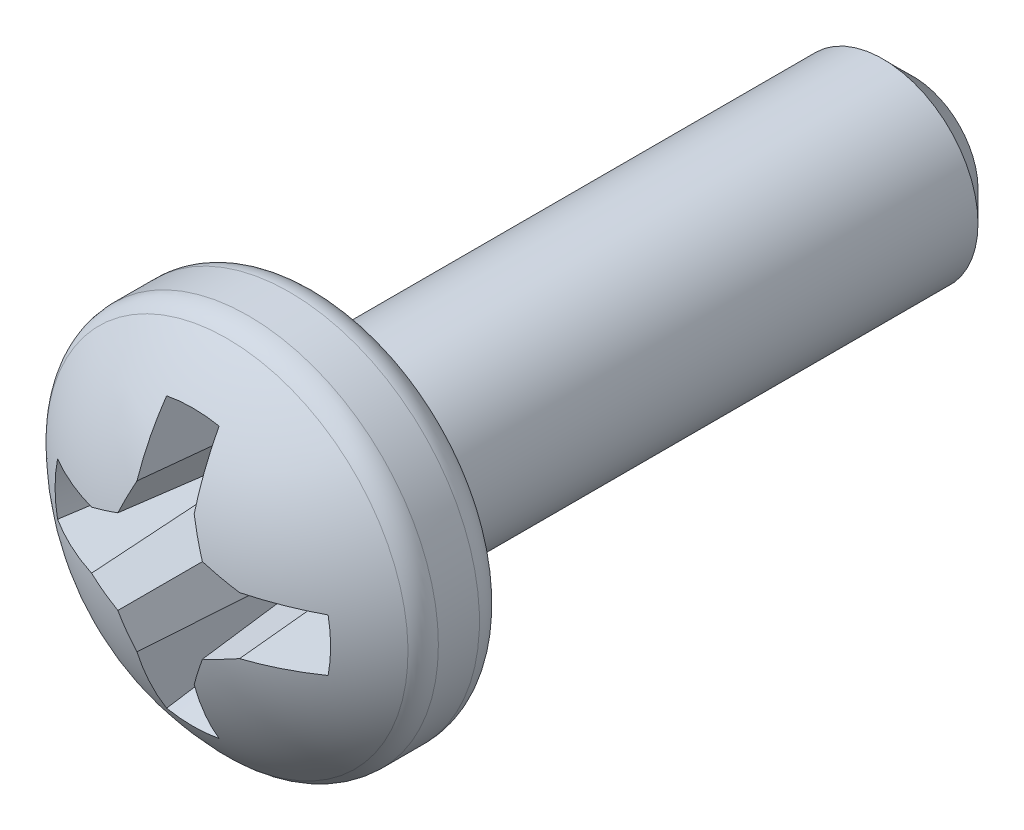
ISO-10303-21;
HEADER;
FILE_DESCRIPTION(('STEP AP214'),'2;1');
FILE_NAME('part.step','',(''),(''),'','','');
FILE_SCHEMA(('AUTOMOTIVE_DESIGN { 1 0 10303 214 1 1 1 1 }'));
ENDSEC;
DATA;
#1=APPLICATION_CONTEXT('core data for automotive mechanical design processes');
#2=APPLICATION_PROTOCOL_DEFINITION('international standard','automotive_design',2000,#1);
#3=PRODUCT_CONTEXT('',#1,'mechanical');
#4=PRODUCT('Part','Part','',(#3));
#5=PRODUCT_RELATED_PRODUCT_CATEGORY('part','',(#4));
#6=PRODUCT_DEFINITION_FORMATION('','',#4);
#7=PRODUCT_DEFINITION_CONTEXT('part definition',#1,'design');
#8=PRODUCT_DEFINITION('design','',#6,#7);
#9=PRODUCT_DEFINITION_SHAPE('','',#8);
#10=(LENGTH_UNIT() NAMED_UNIT(*) SI_UNIT(.MILLI.,.METRE.));
#11=(NAMED_UNIT(*) PLANE_ANGLE_UNIT() SI_UNIT($,.RADIAN.));
#12=(NAMED_UNIT(*) SI_UNIT($,.STERADIAN.) SOLID_ANGLE_UNIT());
#13=UNCERTAINTY_MEASURE_WITH_UNIT(LENGTH_MEASURE(1.E-05),#10,'distance_accuracy_value','');
#14=(GEOMETRIC_REPRESENTATION_CONTEXT(3) GLOBAL_UNCERTAINTY_ASSIGNED_CONTEXT((#13)) GLOBAL_UNIT_ASSIGNED_CONTEXT((#10,
#11,#12)) REPRESENTATION_CONTEXT('',''));
#15=CARTESIAN_POINT('',(0.,0.,0.));
#16=DIRECTION('',(0.,0.,1.));
#17=DIRECTION('',(1.,0.,0.));
#18=AXIS2_PLACEMENT_3D('',#15,#16,#17);
#19=CARTESIAN_POINT('',(-1.1583216746158,0.791461441644268,0.413196607862429));
#20=DIRECTION('',(0.,0.,1.));
#21=DIRECTION('',(1.,0.,0.));
#22=AXIS2_PLACEMENT_3D('',#19,#20,#21);
#23=PLANE('',#22);
#24=DIRECTION('',(0.382683432365081,-0.92387953251129,0.));
#25=VECTOR('',#24,1.);
#26=CARTESIAN_POINT('',(-1.14500778784592,0.796976234112247,0.413196607862429));
#27=LINE('',#26,#25);
#28=CARTESIAN_POINT('',(-1.1525780332613,0.815252423264536,0.413196607862429));
#29=VERTEX_POINT('',#28);
#30=CARTESIAN_POINT('',(-1.14729208967984,0.802491026580227,0.413196607862429));
#31=VERTEX_POINT('',#30);
#32=EDGE_CURVE('E292',#29,#31,#27,.T.);
#33=ORIENTED_EDGE('',*,*,#32,.F.);
#34=DIRECTION('',(0.,1.,0.));
#35=VECTOR('',#34,1.);
#36=CARTESIAN_POINT('',(-1.15257803326131,0.791461441644268,0.413196607862429));
#37=LINE('',#36,#35);
#38=CARTESIAN_POINT('',(-1.15257803326131,0.827667770292575,0.413196607862429));
#39=VERTEX_POINT('',#38);
#40=EDGE_CURVE('E168',#39,#29,#37,.F.);
#41=ORIENTED_EDGE('',*,*,#40,.F.);
#42=CARTESIAN_POINT('',(-1.1583216746158,0.791461441644268,0.413196607862429));
#43=DIRECTION('',(0.,0.,1.));
#44=DIRECTION('',(1.,0.,0.));
#45=AXIS2_PLACEMENT_3D('',#42,#43,#44);
#46=CIRCLE('',#45,0.0366590732315792);
#47=CARTESIAN_POINT('',(-1.16406531597029,0.827667770292577,0.413196607862429));
#48=VERTEX_POINT('',#47);
#49=EDGE_CURVE('E159',#39,#48,#46,.T.);
#50=ORIENTED_EDGE('',*,*,#49,.T.);
#51=DIRECTION('',(0.,1.,0.));
#52=VECTOR('',#51,1.);
#53=CARTESIAN_POINT('',(-1.16406531597029,0.791461441644271,0.413196607862429));
#54=LINE('',#53,#52);
#55=CARTESIAN_POINT('',(-1.16406531597029,0.815252423264539,0.413196607862429));
#56=VERTEX_POINT('',#55);
#57=EDGE_CURVE('E166',#56,#48,#54,.T.);
#58=ORIENTED_EDGE('',*,*,#57,.F.);
#59=DIRECTION('',(0.382683432365079,0.923879532511291,0.));
#60=VECTOR('',#59,1.);
#61=CARTESIAN_POINT('',(-1.17163556138567,0.79697623411225,0.413196607862429));
#62=LINE('',#61,#60);
#63=CARTESIAN_POINT('',(-1.16935125955175,0.80249102658023,0.413196607862429));
#64=VERTEX_POINT('',#63);
#65=EDGE_CURVE('E301',#64,#56,#62,.T.);
#66=ORIENTED_EDGE('',*,*,#65,.F.);
#67=DIRECTION('',(0.923879532511289,0.382683432365086,0.));
#68=VECTOR('',#67,1.);
#69=CARTESIAN_POINT('',(-1.16383646708377,0.804775328414139,0.413196607862429));
#70=LINE('',#69,#68);
#71=CARTESIAN_POINT('',(-1.18211265623606,0.797205082998765,0.413196607862429));
#72=VERTEX_POINT('',#71);
#73=EDGE_CURVE('E307',#72,#64,#70,.T.);
#74=ORIENTED_EDGE('',*,*,#73,.F.);
#75=DIRECTION('',(1.,0.,0.));
#76=VECTOR('',#75,1.);
#77=CARTESIAN_POINT('',(-1.15832167461579,0.797205082998765,0.413196607862429));
#78=LINE('',#77,#76);
#79=CARTESIAN_POINT('',(-1.19452800332347,0.797205082997996,0.413196607853643));
#80=VERTEX_POINT('',#79);
#81=EDGE_CURVE('E313',#80,#72,#78,.T.);
#82=ORIENTED_EDGE('',*,*,#81,.F.);
#83=CARTESIAN_POINT('',(-1.15832167461579,0.791461441644271,0.413196607862429));
#84=DIRECTION('',(0.,0.,1.));
#85=DIRECTION('',(1.,0.,0.));
#86=AXIS2_PLACEMENT_3D('',#83,#84,#85);
#87=CIRCLE('',#86,0.0366590732924525);
#88=CARTESIAN_POINT('',(-1.19452800332573,0.78571780028978,0.413196607862429));
#89=VERTEX_POINT('',#88);
#90=EDGE_CURVE('E410',#80,#89,#87,.T.);
#91=ORIENTED_EDGE('',*,*,#90,.T.);
#92=DIRECTION('',(1.,0.,0.));
#93=VECTOR('',#92,1.);
#94=CARTESIAN_POINT('',(-1.1583216746158,0.78571780028978,0.413196607862429));
#95=LINE('',#94,#93);
#96=CARTESIAN_POINT('',(-1.18211265623607,0.78571780028978,0.413196607862429));
#97=VERTEX_POINT('',#96);
#98=EDGE_CURVE('E247',#97,#89,#95,.F.);
#99=ORIENTED_EDGE('',*,*,#98,.F.);
#100=DIRECTION('',(-0.923879532511292,0.382683432365076,0.));
#101=VECTOR('',#100,1.);
#102=CARTESIAN_POINT('',(-1.16383646708378,0.778147554874406,0.413196607862429));
#103=LINE('',#102,#101);
#104=CARTESIAN_POINT('',(-1.16935125955175,0.780431856708312,0.413196607862429));
#105=VERTEX_POINT('',#104);
#106=EDGE_CURVE('E248',#105,#97,#103,.T.);
#107=ORIENTED_EDGE('',*,*,#106,.F.);
#108=DIRECTION('',(-0.38268343236509,0.923879532511287,0.));
#109=VECTOR('',#108,1.);
#110=CARTESIAN_POINT('',(-1.17163556138567,0.785946649176296,0.413196607862429));
#111=LINE('',#110,#109);
#112=CARTESIAN_POINT('',(-1.16406531597029,0.767670460024005,0.413196607862429));
#113=VERTEX_POINT('',#112);
#114=EDGE_CURVE('E254',#113,#105,#111,.T.);
#115=ORIENTED_EDGE('',*,*,#114,.F.);
#116=DIRECTION('',(0.,1.,0.));
#117=VECTOR('',#116,1.);
#118=CARTESIAN_POINT('',(-1.16406531597029,0.791461441644275,0.413196607862429));
#119=LINE('',#118,#117);
#120=CARTESIAN_POINT('',(-1.16406531597029,0.755255112953835,0.413196607862429));
#121=VERTEX_POINT('',#120);
#122=EDGE_CURVE('E260',#121,#113,#119,.T.);
#123=ORIENTED_EDGE('',*,*,#122,.F.);
#124=CARTESIAN_POINT('',(-1.1583216746158,0.791461441644275,0.413196607862429));
#125=DIRECTION('',(0.,0.,1.));
#126=DIRECTION('',(1.,0.,0.));
#127=AXIS2_PLACEMENT_3D('',#124,#125,#126);
#128=CIRCLE('',#127,0.036659073273191);
#129=CARTESIAN_POINT('',(-1.1525780332613,0.755255112953836,0.413196607862429));
#130=VERTEX_POINT('',#129);
#131=EDGE_CURVE('E336',#121,#130,#128,.T.);
#132=ORIENTED_EDGE('',*,*,#131,.T.);
#133=DIRECTION('',(0.,1.,0.));
#134=VECTOR('',#133,1.);
#135=CARTESIAN_POINT('',(-1.1525780332613,0.791461441644272,0.413196607862429));
#136=LINE('',#135,#134);
#137=CARTESIAN_POINT('',(-1.15257803326131,0.767670460024002,0.413196607862429));
#138=VERTEX_POINT('',#137);
#139=EDGE_CURVE('E266',#138,#130,#136,.F.);
#140=ORIENTED_EDGE('',*,*,#139,.F.);
#141=DIRECTION('',(-0.382683432365075,-0.923879532511293,0.));
#142=VECTOR('',#141,1.);
#143=CARTESIAN_POINT('',(-1.14500778784593,0.785946649176293,0.413196607862429));
#144=LINE('',#143,#142);
#145=CARTESIAN_POINT('',(-1.14729208967984,0.780431856708314,0.413196607862429));
#146=VERTEX_POINT('',#145);
#147=EDGE_CURVE('E267',#146,#138,#144,.T.);
#148=ORIENTED_EDGE('',*,*,#147,.F.);
#149=DIRECTION('',(-0.923879532511286,-0.382683432365092,0.));
#150=VECTOR('',#149,1.);
#151=CARTESIAN_POINT('',(-1.15280688214782,0.778147554874402,0.413196607862429));
#152=LINE('',#151,#150);
#153=CARTESIAN_POINT('',(-1.13453069299553,0.785717800289777,0.413196607862429));
#154=VERTEX_POINT('',#153);
#155=EDGE_CURVE('E273',#154,#146,#152,.T.);
#156=ORIENTED_EDGE('',*,*,#155,.F.);
#157=DIRECTION('',(1.,0.,0.));
#158=VECTOR('',#157,1.);
#159=CARTESIAN_POINT('',(-1.1583216746158,0.785717800289777,0.413196607862429));
#160=LINE('',#159,#158);
#161=CARTESIAN_POINT('',(-1.12211534596749,0.785717800289777,0.413196607862429));
#162=VERTEX_POINT('',#161);
#163=EDGE_CURVE('E279',#162,#154,#160,.F.);
#164=ORIENTED_EDGE('',*,*,#163,.F.);
#165=CARTESIAN_POINT('',(-1.1583216746158,0.791461441644268,0.413196607862429));
#166=DIRECTION('',(0.,0.,1.));
#167=DIRECTION('',(1.,0.,0.));
#168=AXIS2_PLACEMENT_3D('',#165,#166,#167);
#169=CIRCLE('',#168,0.0366590732315792);
#170=CARTESIAN_POINT('',(-1.12211534596749,0.797205082998762,0.413196607862429));
#171=VERTEX_POINT('',#170);
#172=EDGE_CURVE('E492',#162,#171,#169,.T.);
#173=ORIENTED_EDGE('',*,*,#172,.T.);
#174=DIRECTION('',(1.,0.,0.));
#175=VECTOR('',#174,1.);
#176=CARTESIAN_POINT('',(-1.1583216746158,0.797205082998762,0.413196607862429));
#177=LINE('',#176,#175);
#178=CARTESIAN_POINT('',(-1.13453069299553,0.797205082998762,0.413196607862429));
#179=VERTEX_POINT('',#178);
#180=EDGE_CURVE('E285',#179,#171,#177,.T.);
#181=ORIENTED_EDGE('',*,*,#180,.F.);
#182=DIRECTION('',(0.92387953251129,-0.382683432365083,0.));
#183=VECTOR('',#182,1.);
#184=CARTESIAN_POINT('',(-1.15280688214782,0.804775328414136,0.413196607862429));
#185=LINE('',#184,#183);
#186=EDGE_CURVE('E286',#31,#179,#185,.T.);
#187=ORIENTED_EDGE('',*,*,#186,.F.);
#188=EDGE_LOOP('',(#33,#41,#50,#58,#66,#74,#82,#91,#99,#107,#115,#123,#132,#140,#148,#156,#164,
#173,#181,#187));
#189=FACE_BOUND('',#188,.T.);
#190=ADVANCED_FACE('F17',(#189),#23,.T.);
#191=CARTESIAN_POINT('',(-1.15832167461579,0.801303961329311,0.460047001563216));
#192=DIRECTION('',(0.,-0.996194698091744,0.0871557427476727));
#193=DIRECTION('',(0.,-0.0871557427476727,-0.996194698091744));
#194=AXIS2_PLACEMENT_3D('',#191,#192,#193);
#195=PLANE('',#194);
#196=DIRECTION('',(0.0173337504938674,-0.0871426484044457,-0.996045029063885));
#197=VECTOR('',#196,1.);
#198=CARTESIAN_POINT('',(-1.18285605674042,0.8009424097128,0.455914447676356));
#199=LINE('',#198,#197);
#200=CARTESIAN_POINT('',(-1.18285605674042,0.8009424097128,0.455914447676357));
#201=VERTEX_POINT('',#200);
#202=EDGE_CURVE('E310',#201,#72,#199,.T.);
#203=ORIENTED_EDGE('',*,*,#202,.F.);
#204=CARTESIAN_POINT('',(-1.2031693076876,0.800151088875881,0.4468696091221));
#205=CARTESIAN_POINT('',(-1.19998094800443,0.800321424804083,0.448816557690385));
#206=CARTESIAN_POINT('',(-1.19669399725059,0.800472536171256,0.450543768520715));
#207=CARTESIAN_POINT('',(-1.18992291360155,0.800736309783544,0.453558714705463));
#208=CARTESIAN_POINT('',(-1.18643878070636,0.800848972028658,0.454846450059882));
#209=CARTESIAN_POINT('',(-1.18285605674048,0.800942409712743,0.455914447676345));
#210=B_SPLINE_CURVE_WITH_KNOTS('',3,(#204,#205,#206,#207,#208,#209),.UNSPECIFIED.,.F.,.F.,(4,2,
4),(0.,0.0111485978671283,0.0222971957342563),.UNSPECIFIED.);
#211=CARTESIAN_POINT('',(-1.20316930767702,0.800151088874494,0.446869609106246));
#212=VERTEX_POINT('',#211);
#213=EDGE_CURVE('E409',#212,#201,#210,.T.);
#214=ORIENTED_EDGE('',*,*,#213,.F.);
#215=CARTESIAN_POINT('',(-1.20316930766644,0.800151088873107,0.446869609090393));
#216=CARTESIAN_POINT('',(-1.20173283988868,0.79966000435443,0.441256487356839));
#217=CARTESIAN_POINT('',(-1.20029449731313,0.799168961608414,0.435643843086987));
#218=CARTESIAN_POINT('',(-1.19741406253147,0.798186959649786,0.424419509338453));
#219=CARTESIAN_POINT('',(-1.19597197032528,0.797696000437175,0.418807819859795));
#220=CARTESIAN_POINT('',(-1.19452800332121,0.797205082997228,0.413196607844861));
#221=B_SPLINE_CURVE_WITH_KNOTS('',3,(#215,#216,#217,#218,#219,#220),.UNSPECIFIED.,.F.,.F.,(4,2,
4),(0.,0.0174443558891334,0.034888712201717),.UNSPECIFIED.);
#222=EDGE_CURVE('E318',#212,#80,#221,.T.);
#223=ORIENTED_EDGE('',*,*,#222,.T.);
#224=ORIENTED_EDGE('',*,*,#81,.T.);
#225=EDGE_LOOP('',(#203,#214,#223,#224));
#226=FACE_BOUND('',#225,.T.);
#227=ADVANCED_FACE('F427',(#226),#195,.T.);
#228=CARTESIAN_POINT('',(-1.16540503991215,0.808562198209984,0.460047001563216));
#229=DIRECTION('',(0.381227206369649,-0.920363891963225,0.0871557427476661));
#230=DIRECTION('',(0.923879532511289,0.382683432365086,0.));
#231=AXIS2_PLACEMENT_3D('',#228,#229,#230);
#232=PLANE('',#231);
#233=DIRECTION('',(0.0666626913468175,-0.0666626913468514,-0.995546167269401));
#234=VECTOR('',#233,1.);
#235=CARTESIAN_POINT('',(-1.17233303830332,0.805472805331793,0.457726739301585));
#236=LINE('',#235,#234);
#237=CARTESIAN_POINT('',(-1.17233303830332,0.805472805331793,0.457726739301586));
#238=VERTEX_POINT('',#237);
#239=EDGE_CURVE('E304',#238,#64,#236,.T.);
#240=ORIENTED_EDGE('',*,*,#239,.F.);
#241=CARTESIAN_POINT('',(-1.18285605674042,0.8009424097128,0.455914447676357));
#242=CARTESIAN_POINT('',(-1.18112568718549,0.801700049456702,0.4563463218226));
#243=CARTESIAN_POINT('',(-1.17938358420493,0.802456402296903,0.456713283197824));
#244=CARTESIAN_POINT('',(-1.17587591139256,0.803966534169899,0.457317380406234));
#245=CARTESIAN_POINT('',(-1.17411034156075,0.804720313202696,0.45755451623942));
#246=CARTESIAN_POINT('',(-1.17233303830331,0.80547280533179,0.457726739301587));
#247=B_SPLINE_CURVE_WITH_KNOTS('',3,(#241,#242,#243,#244,#245,#246),.UNSPECIFIED.,.F.,.F.,(4,2,
4),(0.,0.0058030059091772,0.0116060118183545),.UNSPECIFIED.);
#248=EDGE_CURVE('E439',#201,#238,#247,.T.);
#249=ORIENTED_EDGE('',*,*,#248,.F.);
#250=ORIENTED_EDGE('',*,*,#202,.T.);
#251=ORIENTED_EDGE('',*,*,#73,.T.);
#252=EDGE_LOOP('',(#240,#249,#250,#251));
#253=FACE_BOUND('',#252,.T.);
#254=ADVANCED_FACE('F431',(#253),#232,.T.);
#255=CARTESIAN_POINT('',(-1.17542243118151,0.79854480694063,0.460047001563216));
#256=DIRECTION('',(0.920363891963229,-0.381227206369643,0.0871557427476506));
#257=DIRECTION('',(0.382683432365079,0.923879532511291,0.));
#258=AXIS2_PLACEMENT_3D('',#255,#256,#257);
#259=PLANE('',#258);
#260=DIRECTION('',(0.0871426484044308,-0.0173337504938857,-0.996045029063886));
#261=VECTOR('',#260,1.);
#262=CARTESIAN_POINT('',(-1.16780264268432,0.8159958237689,0.455914447676355));
#263=LINE('',#262,#261);
#264=CARTESIAN_POINT('',(-1.16780264268432,0.8159958237689,0.455914447676355));
#265=VERTEX_POINT('',#264);
#266=EDGE_CURVE('E176',#265,#56,#263,.T.);
#267=ORIENTED_EDGE('',*,*,#266,.F.);
#268=CARTESIAN_POINT('',(-1.17233303830332,0.805472805331793,0.457726739301586));
#269=CARTESIAN_POINT('',(-1.17158054617422,0.807250108589228,0.457554516239418));
#270=CARTESIAN_POINT('',(-1.17082676714142,0.809015678421038,0.457317380406232));
#271=CARTESIAN_POINT('',(-1.16931663526843,0.812523351233407,0.456713283197821));
#272=CARTESIAN_POINT('',(-1.16856028242823,0.814265454213967,0.456346321822597));
#273=CARTESIAN_POINT('',(-1.16780264268432,0.815995823768902,0.455914447676354));
#274=B_SPLINE_CURVE_WITH_KNOTS('',3,(#268,#269,#270,#271,#272,#273),.UNSPECIFIED.,.F.,.F.,(4,2,
4),(0.,0.00580300590917752,0.0116060118183552),.UNSPECIFIED.);
#275=EDGE_CURVE('E445',#238,#265,#274,.T.);
#276=ORIENTED_EDGE('',*,*,#275,.F.);
#277=ORIENTED_EDGE('',*,*,#239,.T.);
#278=ORIENTED_EDGE('',*,*,#65,.T.);
#279=EDGE_LOOP('',(#267,#276,#277,#278));
#280=FACE_BOUND('',#279,.T.);
#281=ADVANCED_FACE('F436',(#280),#259,.T.);
#282=CARTESIAN_POINT('',(-1.16816419430083,0.791461441644271,0.460047001563216));
#283=DIRECTION('',(0.996194698091747,0.,0.0871557427476441));
#284=DIRECTION('',(0.0871557427476441,0.,-0.996194698091747));
#285=AXIS2_PLACEMENT_3D('',#282,#283,#284);
#286=PLANE('',#285);
#287=CARTESIAN_POINT('',(-1.16406531597622,0.827667770301505,0.413196607882833));
#288=CARTESIAN_POINT('',(-1.164556233414,0.829111737310763,0.41880781989674));
#289=CARTESIAN_POINT('',(-1.16504719262512,0.830553829522724,0.424419509374164));
#290=CARTESIAN_POINT('',(-1.16602919458211,0.833434264317094,0.435643843119816));
#291=CARTESIAN_POINT('',(-1.16652023732799,0.834872606899593,0.44125648738802));
#292=CARTESIAN_POINT('',(-1.16701132184719,0.836309074684887,0.446869609119717));
#293=B_SPLINE_CURVE_WITH_KNOTS('',3,(#287,#288,#289,#290,#291,#292),.UNSPECIFIED.,.F.,.F.,(4,2,
4),(0.,0.0174443563129265,0.0348887122024039),.UNSPECIFIED.);
#294=CARTESIAN_POINT('',(-1.16701132184662,0.836309074683216,0.446869609113192));
#295=VERTEX_POINT('',#294);
#296=EDGE_CURVE('E170',#48,#295,#293,.T.);
#297=ORIENTED_EDGE('',*,*,#296,.T.);
#298=CARTESIAN_POINT('',(-1.16780264268432,0.815995823768901,0.455914447676355));
#299=CARTESIAN_POINT('',(-1.16770920500028,0.819578547731976,0.454846450060737));
#300=CARTESIAN_POINT('',(-1.16759654275525,0.823062680624549,0.453558714707491));
#301=CARTESIAN_POINT('',(-1.16733276914321,0.82983376426869,0.450543768525744));
#302=CARTESIAN_POINT('',(-1.1671816577762,0.833120715020258,0.448816557697243));
#303=CARTESIAN_POINT('',(-1.16701132184819,0.836309074701324,0.446869609131115));
#304=B_SPLINE_CURVE_WITH_KNOTS('',3,(#298,#299,#300,#301,#302,#303),.UNSPECIFIED.,.F.,.F.,(4,2,
4),(0.,0.0111485978585235,0.022297195717047),.UNSPECIFIED.);
#305=EDGE_CURVE('E450',#265,#295,#304,.T.);
#306=ORIENTED_EDGE('',*,*,#305,.F.);
#307=ORIENTED_EDGE('',*,*,#266,.T.);
#308=ORIENTED_EDGE('',*,*,#57,.T.);
#309=EDGE_LOOP('',(#297,#306,#307,#308));
#310=FACE_BOUND('',#309,.T.);
#311=ADVANCED_FACE('F173',(#310),#286,.T.);
#312=CARTESIAN_POINT('',(-1.1583216746158,0.791461441644268,0.446869608992984));
#313=DIRECTION('',(0.,0.,1.));
#314=DIRECTION('',(1.,0.,0.));
#315=AXIS2_PLACEMENT_3D('',#312,#313,#314);
#316=CONICAL_SURFACE('',#315,0.0456817267104638,0.261799388331704);
#317=ORIENTED_EDGE('',*,*,#296,.F.);
#318=ORIENTED_EDGE('',*,*,#49,.F.);
#319=CARTESIAN_POINT('',(-1.14963202737867,0.836309074691168,0.446869609127301));
#320=CARTESIAN_POINT('',(-1.15012311189992,0.834872606903715,0.441256487393247));
#321=CARTESIAN_POINT('',(-1.15061415464769,0.833434264319156,0.43564384312265));
#322=CARTESIAN_POINT('',(-1.15159615660818,0.830553829520865,0.424419509372134));
#323=CARTESIAN_POINT('',(-1.1520871158209,0.829111737307042,0.418807819892238));
#324=CARTESIAN_POINT('',(-1.15257803326013,0.827667770296023,0.413196607875822));
#325=B_SPLINE_CURVE_WITH_KNOTS('',3,(#319,#320,#321,#322,#323,#324),.UNSPECIFIED.,.F.,.F.,(4,2,
4),(0.,0.017444355898419,0.0348887122202896),.UNSPECIFIED.);
#326=CARTESIAN_POINT('',(-1.14963202738351,0.836309074694346,0.44686960912988));
#327=VERTEX_POINT('',#326);
#328=EDGE_CURVE('E182',#327,#39,#325,.T.);
#329=ORIENTED_EDGE('',*,*,#328,.F.);
#330=CARTESIAN_POINT('',(-1.1583216746158,0.791461441644268,0.44686960910667));
#331=DIRECTION('',(0.,0.,1.));
#332=DIRECTION('',(1.,0.,0.));
#333=AXIS2_PLACEMENT_3D('',#330,#331,#332);
#334=CIRCLE('',#333,0.0456817267409261);
#335=EDGE_CURVE('E180',#295,#327,#334,.F.);
#336=ORIENTED_EDGE('',*,*,#335,.F.);
#337=EDGE_LOOP('',(#317,#318,#329,#336));
#338=FACE_BOUND('',#337,.T.);
#339=ADVANCED_FACE('F178',(#338),#316,.F.);
#340=CARTESIAN_POINT('',(-1.14847915493076,0.791461441644268,0.460047001563216));
#341=DIRECTION('',(-0.996194698091746,0.,0.0871557427476584));
#342=DIRECTION('',(0.0871557427476584,0.,0.996194698091746));
#343=AXIS2_PLACEMENT_3D('',#340,#341,#342);
#344=PLANE('',#343);
#345=DIRECTION('',(-0.0871426484044237,-0.0173337504939004,-0.996045029063886));
#346=VECTOR('',#345,1.);
#347=CARTESIAN_POINT('',(-1.14884070654726,0.815995823768898,0.455914447676356));
#348=LINE('',#347,#346);
#349=CARTESIAN_POINT('',(-1.14884070654726,0.815995823768898,0.455914447676355));
#350=VERTEX_POINT('',#349);
#351=EDGE_CURVE('E295',#350,#29,#348,.T.);
#352=ORIENTED_EDGE('',*,*,#351,.F.);
#353=CARTESIAN_POINT('',(-1.14963202738341,0.836309074701495,0.44686960913101));
#354=CARTESIAN_POINT('',(-1.14946169145541,0.833120715020407,0.448816557697162));
#355=CARTESIAN_POINT('',(-1.14931058008839,0.829833764268814,0.450543768525683));
#356=CARTESIAN_POINT('',(-1.14904680647634,0.823062680624619,0.453558714707463));
#357=CARTESIAN_POINT('',(-1.14893414423131,0.819578547732017,0.454846450060722));
#358=CARTESIAN_POINT('',(-1.14884070654727,0.815995823768911,0.45591444767635));
#359=B_SPLINE_CURVE_WITH_KNOTS('',3,(#353,#354,#355,#356,#357,#358),.UNSPECIFIED.,.F.,.F.,(4,2,
4),(0.,0.0111485978586184,0.0222971957172367),.UNSPECIFIED.);
#360=EDGE_CURVE('E210',#327,#350,#359,.T.);
#361=ORIENTED_EDGE('',*,*,#360,.F.);
#362=ORIENTED_EDGE('',*,*,#328,.T.);
#363=ORIENTED_EDGE('',*,*,#40,.T.);
#364=EDGE_LOOP('',(#352,#361,#362,#363));
#365=FACE_BOUND('',#364,.T.);
#366=ADVANCED_FACE('F199',(#365),#344,.T.);
#367=CARTESIAN_POINT('',(-1.14122091805008,0.798544806940627,0.460047001563216));
#368=DIRECTION('',(-0.920363891963228,-0.381227206369645,0.0871557427476584));
#369=DIRECTION('',(0.382683432365081,-0.92387953251129,0.));
#370=AXIS2_PLACEMENT_3D('',#367,#368,#369);
#371=PLANE('',#370);
#372=DIRECTION('',(-0.0666626913467981,-0.066662691346849,-0.995546167269402));
#373=VECTOR('',#372,1.);
#374=CARTESIAN_POINT('',(-1.14431031092828,0.805472805331788,0.457726739301586));
#375=LINE('',#374,#373);
#376=CARTESIAN_POINT('',(-1.14431031092828,0.805472805331788,0.457726739301586));
#377=VERTEX_POINT('',#376);
#378=EDGE_CURVE('E289',#377,#31,#375,.T.);
#379=ORIENTED_EDGE('',*,*,#378,.F.);
#380=CARTESIAN_POINT('',(-1.14884070654726,0.815995823768898,0.455914447676354));
#381=CARTESIAN_POINT('',(-1.14808306680336,0.814265454213963,0.456346321822597));
#382=CARTESIAN_POINT('',(-1.14732671396316,0.812523351233404,0.456713283197821));
#383=CARTESIAN_POINT('',(-1.14581658209016,0.809015678421035,0.457317380406231));
#384=CARTESIAN_POINT('',(-1.14506280305737,0.807250108589225,0.457554516239417));
#385=CARTESIAN_POINT('',(-1.14431031092827,0.80547280533179,0.457726739301585));
#386=B_SPLINE_CURVE_WITH_KNOTS('',3,(#380,#381,#382,#383,#384,#385),.UNSPECIFIED.,.F.,.F.,(4,2,
4),(0.,0.00580300590917688,0.0116060118183539),.UNSPECIFIED.);
#387=EDGE_CURVE('E218',#350,#377,#386,.T.);
#388=ORIENTED_EDGE('',*,*,#387,.F.);
#389=ORIENTED_EDGE('',*,*,#351,.T.);
#390=ORIENTED_EDGE('',*,*,#32,.T.);
#391=EDGE_LOOP('',(#379,#388,#389,#390));
#392=FACE_BOUND('',#391,.T.);
#393=ADVANCED_FACE('F204',(#392),#371,.T.);
#394=CARTESIAN_POINT('',(-1.15123830931944,0.808562198209981,0.460047001563216));
#395=DIRECTION('',(-0.381227206369647,-0.920363891963227,0.0871557427476583));
#396=DIRECTION('',(0.92387953251129,-0.382683432365083,0.));
#397=AXIS2_PLACEMENT_3D('',#394,#395,#396);
#398=PLANE('',#397);
#399=DIRECTION('',(-0.0173337504938674,-0.0871426484044405,-0.996045029063885));
#400=VECTOR('',#399,1.);
#401=CARTESIAN_POINT('',(-1.13378729249117,0.800942409712797,0.455914447676356));
#402=LINE('',#401,#400);
#403=CARTESIAN_POINT('',(-1.13378729249117,0.800942409712797,0.455914447676355));
#404=VERTEX_POINT('',#403);
#405=EDGE_CURVE('E282',#404,#179,#402,.T.);
#406=ORIENTED_EDGE('',*,*,#405,.F.);
#407=CARTESIAN_POINT('',(-1.14431031092828,0.805472805331788,0.457726739301586));
#408=CARTESIAN_POINT('',(-1.14253300767084,0.804720313202693,0.457554516239419));
#409=CARTESIAN_POINT('',(-1.14076743783903,0.803966534169897,0.457317380406232));
#410=CARTESIAN_POINT('',(-1.13725976502666,0.8024564022969,0.456713283197822));
#411=CARTESIAN_POINT('',(-1.13551766204611,0.801700049456699,0.456346321822598));
#412=CARTESIAN_POINT('',(-1.13378729249117,0.800942409712797,0.455914447676355));
#413=B_SPLINE_CURVE_WITH_KNOTS('',3,(#407,#408,#409,#410,#411,#412),.UNSPECIFIED.,.F.,.F.,(4,2,
4),(0.,0.00580300590917771,0.0116060118183556),.UNSPECIFIED.);
#414=EDGE_CURVE('E462',#377,#404,#413,.T.);
#415=ORIENTED_EDGE('',*,*,#414,.F.);
#416=ORIENTED_EDGE('',*,*,#378,.T.);
#417=ORIENTED_EDGE('',*,*,#186,.T.);
#418=EDGE_LOOP('',(#406,#415,#416,#417));
#419=FACE_BOUND('',#418,.T.);
#420=ADVANCED_FACE('F474',(#419),#398,.T.);
#421=CARTESIAN_POINT('',(-1.1583216746158,0.801303961329307,0.460047001563216));
#422=DIRECTION('',(0.,-0.996194698091746,0.0871557427476584));
#423=DIRECTION('',(0.,-0.0871557427476584,-0.996194698091746));
#424=AXIS2_PLACEMENT_3D('',#421,#422,#423);
#425=PLANE('',#424);
#426=CARTESIAN_POINT('',(-1.12211534596228,0.797205083000532,0.413196607882663));
#427=CARTESIAN_POINT('',(-1.12067137895129,0.797696000440356,0.418807819896193));
#428=CARTESIAN_POINT('',(-1.11922928673814,0.798186959652843,0.424419509373442));
#429=CARTESIAN_POINT('',(-1.11634885194253,0.799168961611224,0.43564384311915));
#430=CARTESIAN_POINT('',(-1.11491050935998,0.799660004357116,0.441256487387585));
#431=CARTESIAN_POINT('',(-1.11347404157518,0.800151088875669,0.446869609119717));
#432=B_SPLINE_CURVE_WITH_KNOTS('',3,(#426,#427,#428,#429,#430,#431),.UNSPECIFIED.,.F.,.F.,(4,2,
4),(0.,0.017444356313646,0.0348887122038415),.UNSPECIFIED.);
#433=CARTESIAN_POINT('',(-1.11347404157685,0.800151088875098,0.446869609113192));
#434=VERTEX_POINT('',#433);
#435=EDGE_CURVE('E351',#171,#434,#432,.T.);
#436=ORIENTED_EDGE('',*,*,#435,.T.);
#437=CARTESIAN_POINT('',(-1.13378729249117,0.800942409712797,0.455914447676355));
#438=CARTESIAN_POINT('',(-1.13020456852808,0.800848972028775,0.45484645006073));
#439=CARTESIAN_POINT('',(-1.1267204356355,0.800736309783744,0.453558714707479));
#440=CARTESIAN_POINT('',(-1.11994935199133,0.800472536171663,0.450543768525723));
#441=CARTESIAN_POINT('',(-1.11666240123975,0.800321424804612,0.448816557697218));
#442=CARTESIAN_POINT('',(-1.11347404155868,0.800151088876552,0.446869609131087));
#443=B_SPLINE_CURVE_WITH_KNOTS('',3,(#437,#438,#439,#440,#441,#442),.UNSPECIFIED.,.F.,.F.,(4,2,
4),(0.,0.0111485978585638,0.0222971957171277),.UNSPECIFIED.);
#444=EDGE_CURVE('E463',#404,#434,#443,.T.);
#445=ORIENTED_EDGE('',*,*,#444,.F.);
#446=ORIENTED_EDGE('',*,*,#405,.T.);
#447=ORIENTED_EDGE('',*,*,#180,.T.);
#448=EDGE_LOOP('',(#436,#445,#446,#447));
#449=FACE_BOUND('',#448,.T.);
#450=ADVANCED_FACE('F477',(#449),#425,.T.);
#451=CARTESIAN_POINT('',(-1.1583216746158,0.791461441644268,0.446869608992984));
#452=DIRECTION('',(0.,0.,1.));
#453=DIRECTION('',(1.,0.,0.));
#454=AXIS2_PLACEMENT_3D('',#451,#452,#453);
#455=CONICAL_SURFACE('',#454,0.0456817267104638,0.261799388331704);
#456=ORIENTED_EDGE('',*,*,#172,.F.);
#457=CARTESIAN_POINT('',(-1.1134740415689,0.78277179440714,0.446869609127301));
#458=CARTESIAN_POINT('',(-1.11491050935641,0.783262878928414,0.441256487393016));
#459=CARTESIAN_POINT('',(-1.11634885194103,0.783753921676205,0.435643843122188));
#460=CARTESIAN_POINT('',(-1.11922928673944,0.784735923636735,0.42441950937121));
#461=CARTESIAN_POINT('',(-1.12067137895332,0.785226882849474,0.418807819891084));
#462=CARTESIAN_POINT('',(-1.1221153459644,0.785717800288727,0.413196607874437));
#463=B_SPLINE_CURVE_WITH_KNOTS('',3,(#457,#458,#459,#460,#461,#462),.UNSPECIFIED.,.F.,.F.,(4,2,
4),(0.,0.0174443558991368,0.0348887122217252),.UNSPECIFIED.);
#464=CARTESIAN_POINT('',(-1.11347404156572,0.782771794411982,0.446869609129879));
#465=VERTEX_POINT('',#464);
#466=EDGE_CURVE('E346',#465,#162,#463,.T.);
#467=ORIENTED_EDGE('',*,*,#466,.F.);
#468=CARTESIAN_POINT('',(-1.1583216746158,0.791461441644268,0.44686960910667));
#469=DIRECTION('',(0.,0.,1.));
#470=DIRECTION('',(1.,0.,0.));
#471=AXIS2_PLACEMENT_3D('',#468,#469,#470);
#472=CIRCLE('',#471,0.0456817267409261);
#473=EDGE_CURVE('E464',#434,#465,#472,.F.);
#474=ORIENTED_EDGE('',*,*,#473,.F.);
#475=ORIENTED_EDGE('',*,*,#435,.F.);
#476=EDGE_LOOP('',(#456,#467,#474,#475));
#477=FACE_BOUND('',#476,.T.);
#478=ADVANCED_FACE('F482',(#477),#455,.F.);
#479=CARTESIAN_POINT('',(-1.1583216746158,0.781618921959232,0.460047001563216));
#480=DIRECTION('',(0.,0.996194698091747,0.0871557427476441));
#481=DIRECTION('',(0.,-0.0871557427476441,0.996194698091747));
#482=AXIS2_PLACEMENT_3D('',#479,#480,#481);
#483=PLANE('',#482);
#484=DIRECTION('',(-0.017333750493867,0.0871426484044184,-0.996045029063887));
#485=VECTOR('',#484,1.);
#486=CARTESIAN_POINT('',(-1.13378729249117,0.781980473575742,0.455914447676357));
#487=LINE('',#486,#485);
#488=CARTESIAN_POINT('',(-1.13378729249117,0.781980473575742,0.455914447676356));
#489=VERTEX_POINT('',#488);
#490=EDGE_CURVE('E276',#489,#154,#487,.T.);
#491=ORIENTED_EDGE('',*,*,#490,.F.);
#492=CARTESIAN_POINT('',(-1.11347404155857,0.782771794411883,0.446869609131008));
#493=CARTESIAN_POINT('',(-1.11666240123965,0.782601458483868,0.448816557697155));
#494=CARTESIAN_POINT('',(-1.11994935199124,0.782450347116853,0.450543768525673));
#495=CARTESIAN_POINT('',(-1.12672043563542,0.782186573504825,0.453558714707451));
#496=CARTESIAN_POINT('',(-1.13020456852801,0.782073911259812,0.454846450060712));
#497=CARTESIAN_POINT('',(-1.13378729249111,0.7819804735758,0.455914447676343));
#498=B_SPLINE_CURVE_WITH_KNOTS('',3,(#492,#493,#494,#495,#496,#497),.UNSPECIFIED.,.F.,.F.,(4,2,
4),(0.,0.0111485978585943,0.0222971957171887),.UNSPECIFIED.);
#499=EDGE_CURVE('E509',#465,#489,#498,.T.);
#500=ORIENTED_EDGE('',*,*,#499,.F.);
#501=ORIENTED_EDGE('',*,*,#466,.T.);
#502=ORIENTED_EDGE('',*,*,#163,.T.);
#503=EDGE_LOOP('',(#491,#500,#501,#502));
#504=FACE_BOUND('',#503,.T.);
#505=ADVANCED_FACE('F499',(#504),#483,.T.);
#506=CARTESIAN_POINT('',(-1.15123830931944,0.774360685078558,0.460047001563216));
#507=DIRECTION('',(-0.381227206369656,0.920363891963225,0.0871557427476397));
#508=DIRECTION('',(-0.923879532511286,-0.382683432365092,0.));
#509=AXIS2_PLACEMENT_3D('',#506,#507,#508);
#510=PLANE('',#509);
#511=DIRECTION('',(-0.0666626913468195,0.0666626913468243,-0.995546167269402));
#512=VECTOR('',#511,1.);
#513=CARTESIAN_POINT('',(-1.14431031092828,0.777450077956753,0.457726739301588));
#514=LINE('',#513,#512);
#515=CARTESIAN_POINT('',(-1.14431031092828,0.777450077956753,0.457726739301588));
#516=VERTEX_POINT('',#515);
#517=EDGE_CURVE('E270',#516,#146,#514,.T.);
#518=ORIENTED_EDGE('',*,*,#517,.F.);
#519=CARTESIAN_POINT('',(-1.13378729249117,0.781980473575742,0.455914447676355));
#520=CARTESIAN_POINT('',(-1.13551766204611,0.78122283383184,0.456346321822598));
#521=CARTESIAN_POINT('',(-1.13725976502667,0.780466480991639,0.456713283197823));
#522=CARTESIAN_POINT('',(-1.14076743783904,0.778956349118642,0.457317380406233));
#523=CARTESIAN_POINT('',(-1.14253300767085,0.778202570085845,0.457554516239419));
#524=CARTESIAN_POINT('',(-1.14431031092828,0.777450077956751,0.457726739301586));
#525=B_SPLINE_CURVE_WITH_KNOTS('',3,(#519,#520,#521,#522,#523,#524),.UNSPECIFIED.,.F.,.F.,(4,2,
4),(0.,0.00580300590917854,0.0116060118183567),.UNSPECIFIED.);
#526=EDGE_CURVE('E515',#489,#516,#525,.T.);
#527=ORIENTED_EDGE('',*,*,#526,.F.);
#528=ORIENTED_EDGE('',*,*,#490,.T.);
#529=ORIENTED_EDGE('',*,*,#155,.T.);
#530=EDGE_LOOP('',(#518,#527,#528,#529));
#531=FACE_BOUND('',#530,.T.);
#532=ADVANCED_FACE('F503',(#531),#510,.T.);
#533=CARTESIAN_POINT('',(-1.14122091805009,0.784378076347913,0.460047001563216));
#534=DIRECTION('',(-0.920363891963232,0.381227206369639,0.0871557427476397));
#535=DIRECTION('',(-0.382683432365075,-0.923879532511293,0.));
#536=AXIS2_PLACEMENT_3D('',#533,#534,#535);
#537=PLANE('',#536);
#538=DIRECTION('',(-0.087142648404425,0.0173337504938365,-0.996045029063887));
#539=VECTOR('',#538,1.);
#540=CARTESIAN_POINT('',(-1.14884070654727,0.766927059519643,0.455914447676357));
#541=LINE('',#540,#539);
#542=CARTESIAN_POINT('',(-1.14884070654727,0.766927059519643,0.455914447676357));
#543=VERTEX_POINT('',#542);
#544=EDGE_CURVE('E263',#543,#138,#541,.T.);
#545=ORIENTED_EDGE('',*,*,#544,.F.);
#546=CARTESIAN_POINT('',(-1.14431031092828,0.777450077956753,0.457726739301587));
#547=CARTESIAN_POINT('',(-1.14506280305738,0.775672774699318,0.45755451623942));
#548=CARTESIAN_POINT('',(-1.14581658209017,0.773907204867509,0.457317380406234));
#549=CARTESIAN_POINT('',(-1.14732671396317,0.770399532055139,0.456713283197824));
#550=CARTESIAN_POINT('',(-1.14808306680337,0.768657429074579,0.4563463218226));
#551=CARTESIAN_POINT('',(-1.14884070654727,0.766927059519644,0.455914447676357));
#552=B_SPLINE_CURVE_WITH_KNOTS('',3,(#546,#547,#548,#549,#550,#551),.UNSPECIFIED.,.F.,.F.,(4,2,
4),(0.,0.00580300590917754,0.0116060118183551),.UNSPECIFIED.);
#553=EDGE_CURVE('E535',#516,#543,#552,.T.);
#554=ORIENTED_EDGE('',*,*,#553,.F.);
#555=ORIENTED_EDGE('',*,*,#517,.T.);
#556=ORIENTED_EDGE('',*,*,#147,.T.);
#557=EDGE_LOOP('',(#545,#554,#555,#556));
#558=FACE_BOUND('',#557,.T.);
#559=ADVANCED_FACE('F548',(#558),#537,.T.);
#560=CARTESIAN_POINT('',(-1.14847915493076,0.791461441644272,0.460047001563216));
#561=DIRECTION('',(-0.996194698091747,0.,0.0871557427476441));
#562=DIRECTION('',(0.0871557427476441,0.,0.996194698091747));
#563=AXIS2_PLACEMENT_3D('',#560,#561,#562);
#564=PLANE('',#563);
#565=CARTESIAN_POINT('',(-1.15257803326265,0.755255112957802,0.413196607847021));
#566=CARTESIAN_POINT('',(-1.15208711582196,0.753811145944539,0.418807819870464));
#567=CARTESIAN_POINT('',(-1.15159615660861,0.752369053729144,0.424419509357631));
#568=CARTESIAN_POINT('',(-1.15061415464849,0.749488618929047,0.435643843123177));
#569=CARTESIAN_POINT('',(-1.15012311190173,0.748050276344255,0.441256487401533));
#570=CARTESIAN_POINT('',(-1.14963202738231,0.74661380855724,0.446869609143589));
#571=B_SPLINE_CURVE_WITH_KNOTS('',3,(#565,#566,#567,#568,#569,#570),.UNSPECIFIED.,.F.,.F.,(4,2,
4),(0.,0.0174443563442536,0.0348887122650567),.UNSPECIFIED.);
#572=CARTESIAN_POINT('',(-1.14963202738144,0.746613808554689,0.446869609153554));
#573=VERTEX_POINT('',#572);
#574=EDGE_CURVE('E559',#130,#573,#571,.T.);
#575=ORIENTED_EDGE('',*,*,#574,.T.);
#576=CARTESIAN_POINT('',(-1.14884070654727,0.766927059519644,0.455914447676356));
#577=CARTESIAN_POINT('',(-1.14893414423134,0.763344335555247,0.454846450060342));
#578=CARTESIAN_POINT('',(-1.14904680647642,0.759860202661435,0.453558714706545));
#579=CARTESIAN_POINT('',(-1.14931058008859,0.753089119014981,0.450543768523385));
#580=CARTESIAN_POINT('',(-1.14946169145568,0.749802168262338,0.448816557694022));
#581=CARTESIAN_POINT('',(-1.14963202738377,0.746613808580281,0.446869609126876));
#582=B_SPLINE_CURVE_WITH_KNOTS('',3,(#576,#577,#578,#579,#580,#581),.UNSPECIFIED.,.F.,.F.,(4,2,
4),(0.,0.0111485978625856,0.022297195725171),.UNSPECIFIED.);
#583=EDGE_CURVE('E536',#543,#573,#582,.T.);
#584=ORIENTED_EDGE('',*,*,#583,.F.);
#585=ORIENTED_EDGE('',*,*,#544,.T.);
#586=ORIENTED_EDGE('',*,*,#139,.T.);
#587=EDGE_LOOP('',(#575,#584,#585,#586));
#588=FACE_BOUND('',#587,.T.);
#589=ADVANCED_FACE('F551',(#588),#564,.T.);
#590=CARTESIAN_POINT('',(-1.1583216746158,0.791461441644275,0.446869609163513));
#591=DIRECTION('',(0.,0.,1.));
#592=DIRECTION('',(0.,-1.,0.));
#593=AXIS2_PLACEMENT_3D('',#590,#591,#592);
#594=CONICAL_SURFACE('',#593,0.0456817267957287,0.261799388275177);
#595=ORIENTED_EDGE('',*,*,#131,.F.);
#596=CARTESIAN_POINT('',(-1.16701132184168,0.746613808565836,0.446869609132135));
#597=CARTESIAN_POINT('',(-1.16652023732581,0.748050276349292,0.441256487392932));
#598=CARTESIAN_POINT('',(-1.16602919458153,0.749488618931386,0.435643843117743));
#599=CARTESIAN_POINT('',(-1.16504719262423,0.752369053727806,0.424419509359163));
#600=CARTESIAN_POINT('',(-1.16455623341121,0.753811145942225,0.418807819875794));
#601=CARTESIAN_POINT('',(-1.16406531596977,0.755255112955371,0.413196607856463));
#602=B_SPLINE_CURVE_WITH_KNOTS('',3,(#596,#597,#598,#599,#600,#601),.UNSPECIFIED.,.F.,.F.,(4,2,
4),(0.,0.0174443559089987,0.0348887122414461),.UNSPECIFIED.);
#603=CARTESIAN_POINT('',(-1.16701132184796,0.746613808570192,0.446869609128392));
#604=VERTEX_POINT('',#603);
#605=EDGE_CURVE('E331',#604,#121,#602,.T.);
#606=ORIENTED_EDGE('',*,*,#605,.F.);
#607=CARTESIAN_POINT('',(-1.1583216746158,0.791461441644275,0.446869609163513));
#608=DIRECTION('',(0.,0.,1.));
#609=DIRECTION('',(0.,-1.,0.));
#610=AXIS2_PLACEMENT_3D('',#607,#608,#609);
#611=CIRCLE('',#610,0.0456817267957287);
#612=EDGE_CURVE('E538',#573,#604,#611,.F.);
#613=ORIENTED_EDGE('',*,*,#612,.F.);
#614=ORIENTED_EDGE('',*,*,#574,.F.);
#615=EDGE_LOOP('',(#595,#606,#613,#614));
#616=FACE_BOUND('',#615,.T.);
#617=ADVANCED_FACE('F555',(#616),#594,.F.);
#618=CARTESIAN_POINT('',(-1.16816419430084,0.791461441644275,0.460047001563216));
#619=DIRECTION('',(0.996194698091746,0.,0.0871557427476584));
#620=DIRECTION('',(0.0871557427476584,0.,-0.996194698091746));
#621=AXIS2_PLACEMENT_3D('',#618,#619,#620);
#622=PLANE('',#621);
#623=DIRECTION('',(0.0871426484044534,0.0173337504937982,-0.996045029063885));
#624=VECTOR('',#623,1.);
#625=CARTESIAN_POINT('',(-1.16780264268433,0.766927059519647,0.455914447676358));
#626=LINE('',#625,#624);
#627=CARTESIAN_POINT('',(-1.16780264268433,0.766927059519647,0.455914447676358));
#628=VERTEX_POINT('',#627);
#629=EDGE_CURVE('E257',#628,#113,#626,.T.);
#630=ORIENTED_EDGE('',*,*,#629,.F.);
#631=CARTESIAN_POINT('',(-1.1670113218478,0.746613808579728,0.446869609126539));
#632=CARTESIAN_POINT('',(-1.1671816577759,0.749802168261863,0.448816557693764));
#633=CARTESIAN_POINT('',(-1.16733276914299,0.753089119014589,0.450543768523195));
#634=CARTESIAN_POINT('',(-1.16759654275517,0.759860202661224,0.453558714706466));
#635=CARTESIAN_POINT('',(-1.16770920500026,0.763344335555132,0.454846450060307));
#636=CARTESIAN_POINT('',(-1.16780264268433,0.766927059519632,0.455914447676352));
#637=B_SPLINE_CURVE_WITH_KNOTS('',3,(#631,#632,#633,#634,#635,#636),.UNSPECIFIED.,.F.,.F.,(4,2,
4),(0.,0.0111485978629033,0.0222971957258064),.UNSPECIFIED.);
#638=EDGE_CURVE('E574',#604,#628,#637,.T.);
#639=ORIENTED_EDGE('',*,*,#638,.F.);
#640=ORIENTED_EDGE('',*,*,#605,.T.);
#641=ORIENTED_EDGE('',*,*,#122,.T.);
#642=EDGE_LOOP('',(#630,#639,#640,#641));
#643=FACE_BOUND('',#642,.T.);
#644=ADVANCED_FACE('F582',(#643),#622,.T.);
#645=CARTESIAN_POINT('',(-1.17542243118151,0.784378076347916,0.460047001563216));
#646=DIRECTION('',(0.920363891963225,0.381227206369654,0.0871557427476474));
#647=DIRECTION('',(-0.38268343236509,0.923879532511287,0.));
#648=AXIS2_PLACEMENT_3D('',#645,#646,#647);
#649=PLANE('',#648);
#650=DIRECTION('',(0.0666626913469932,0.0666626913467362,-0.995546167269397));
#651=VECTOR('',#650,1.);
#652=CARTESIAN_POINT('',(-1.17233303830332,0.777450077956755,0.457726739301588));
#653=LINE('',#652,#651);
#654=CARTESIAN_POINT('',(-1.17233303830332,0.777450077956755,0.457726739301587));
#655=VERTEX_POINT('',#654);
#656=EDGE_CURVE('E251',#655,#105,#653,.T.);
#657=ORIENTED_EDGE('',*,*,#656,.F.);
#658=CARTESIAN_POINT('',(-1.16780264268433,0.766927059519647,0.455914447676358));
#659=CARTESIAN_POINT('',(-1.16856028242823,0.768657429074582,0.456346321822601));
#660=CARTESIAN_POINT('',(-1.16931663526843,0.770399532055142,0.456713283197825));
#661=CARTESIAN_POINT('',(-1.17082676714143,0.773907204867512,0.457317380406235));
#662=CARTESIAN_POINT('',(-1.17158054617422,0.775672774699321,0.457554516239421));
#663=CARTESIAN_POINT('',(-1.17233303830332,0.777450077956756,0.457726739301588));
#664=B_SPLINE_CURVE_WITH_KNOTS('',3,(#658,#659,#660,#661,#662,#663),.UNSPECIFIED.,.F.,.F.,(4,2,
4),(0.,0.00580300590917749,0.0116060118183551),.UNSPECIFIED.);
#665=EDGE_CURVE('E575',#628,#655,#664,.T.);
#666=ORIENTED_EDGE('',*,*,#665,.F.);
#667=ORIENTED_EDGE('',*,*,#629,.T.);
#668=ORIENTED_EDGE('',*,*,#114,.T.);
#669=EDGE_LOOP('',(#657,#666,#667,#668));
#670=FACE_BOUND('',#669,.T.);
#671=ADVANCED_FACE('F585',(#670),#649,.T.);
#672=CARTESIAN_POINT('',(-1.16540503991216,0.774360685078562,0.460047001563217));
#673=DIRECTION('',(0.381227206369641,0.920363891963232,0.0871557427476319));
#674=DIRECTION('',(-0.923879532511292,0.382683432365076,0.));
#675=AXIS2_PLACEMENT_3D('',#672,#673,#674);
#676=PLANE('',#675);
#677=DIRECTION('',(0.0173337504936294,0.0871426484044137,-0.996045029063892));
#678=VECTOR('',#677,1.);
#679=CARTESIAN_POINT('',(-1.18285605674042,0.781980473575746,0.455914447676357));
#680=LINE('',#679,#678);
#681=CARTESIAN_POINT('',(-1.18285605674042,0.781980473575746,0.455914447676358));
#682=VERTEX_POINT('',#681);
#683=EDGE_CURVE('E244',#682,#97,#680,.T.);
#684=ORIENTED_EDGE('',*,*,#683,.F.);
#685=CARTESIAN_POINT('',(-1.17233303830332,0.777450077956755,0.457726739301587));
#686=CARTESIAN_POINT('',(-1.17411034156075,0.778202570085848,0.45755451623942));
#687=CARTESIAN_POINT('',(-1.17587591139256,0.778956349118644,0.457317380406234));
#688=CARTESIAN_POINT('',(-1.17938358420493,0.78046648099164,0.456713283197824));
#689=CARTESIAN_POINT('',(-1.18112568718549,0.78122283383184,0.4563463218226));
#690=CARTESIAN_POINT('',(-1.18285605674042,0.781980473575743,0.455914447676358));
#691=B_SPLINE_CURVE_WITH_KNOTS('',3,(#685,#686,#687,#688,#689,#690),.UNSPECIFIED.,.F.,.F.,(4,2,
4),(0.,0.0058030059091738,0.0116060118183477),.UNSPECIFIED.);
#692=EDGE_CURVE('E388',#655,#682,#691,.T.);
#693=ORIENTED_EDGE('',*,*,#692,.F.);
#694=ORIENTED_EDGE('',*,*,#656,.T.);
#695=ORIENTED_EDGE('',*,*,#106,.T.);
#696=EDGE_LOOP('',(#684,#693,#694,#695));
#697=FACE_BOUND('',#696,.T.);
#698=ADVANCED_FACE('F397',(#697),#676,.T.);
#699=CARTESIAN_POINT('',(-1.1583216746158,0.781618921959236,0.460047001563216));
#700=DIRECTION('',(0.,0.996194698091748,0.0871557427476297));
#701=DIRECTION('',(0.,-0.0871557427476297,0.996194698091748));
#702=AXIS2_PLACEMENT_3D('',#699,#700,#701);
#703=PLANE('',#702);
#704=CARTESIAN_POINT('',(-1.1945280033184,0.785717800294764,0.413196607846229));
#705=CARTESIAN_POINT('',(-1.19597197032391,0.785226882853084,0.418807819860587));
#706=CARTESIAN_POINT('',(-1.19741406253105,0.78473592363932,0.424419509338843));
#707=CARTESIAN_POINT('',(-1.20029449731364,0.783753921679543,0.435643843086921));
#708=CARTESIAN_POINT('',(-1.20173283988918,0.783262878933532,0.441256487356719));
#709=CARTESIAN_POINT('',(-1.20316930766644,0.782771794415439,0.446869609090393));
#710=B_SPLINE_CURVE_WITH_KNOTS('',3,(#704,#705,#706,#707,#708,#709),.UNSPECIFIED.,.F.,.F.,(4,2,
4),(0.,0.017444356312418,0.0348887122013845),.UNSPECIFIED.);
#711=CARTESIAN_POINT('',(-1.20316930766125,0.782771794417214,0.44686960907011));
#712=VERTEX_POINT('',#711);
#713=EDGE_CURVE('E403',#89,#712,#710,.T.);
#714=ORIENTED_EDGE('',*,*,#713,.T.);
#715=CARTESIAN_POINT('',(-1.18285605674042,0.781980473575746,0.455914447676358));
#716=CARTESIAN_POINT('',(-1.18643878070632,0.78207391125984,0.454846450059893));
#717=CARTESIAN_POINT('',(-1.18992291360153,0.782186573504974,0.45355871470547));
#718=CARTESIAN_POINT('',(-1.19669399725061,0.782450347117318,0.450543768520711));
#719=CARTESIAN_POINT('',(-1.19998094800447,0.782601458484529,0.448816557690375));
#720=CARTESIAN_POINT('',(-1.20316930768765,0.782771794412778,0.446869609122082));
#721=B_SPLINE_CURVE_WITH_KNOTS('',3,(#715,#716,#717,#718,#719,#720),.UNSPECIFIED.,.F.,.F.,(4,2,
4),(0.,0.0111485978671913,0.0222971957343827),.UNSPECIFIED.);
#722=EDGE_CURVE('E382',#682,#712,#721,.T.);
#723=ORIENTED_EDGE('',*,*,#722,.F.);
#724=ORIENTED_EDGE('',*,*,#683,.T.);
#725=ORIENTED_EDGE('',*,*,#98,.T.);
#726=EDGE_LOOP('',(#714,#723,#724,#725));
#727=FACE_BOUND('',#726,.T.);
#728=ADVANCED_FACE('F394',(#727),#703,.T.);
#729=CARTESIAN_POINT('',(-1.15832167461579,0.791461441644271,0.446869608879295));
#730=DIRECTION('',(0.,0.,1.));
#731=DIRECTION('',(0.,-1.,0.));
#732=AXIS2_PLACEMENT_3D('',#729,#730,#731);
#733=CONICAL_SURFACE('',#732,0.0456817266972227,0.261799387122199);
#734=ORIENTED_EDGE('',*,*,#90,.F.);
#735=ORIENTED_EDGE('',*,*,#222,.F.);
#736=CARTESIAN_POINT('',(-1.15832167461579,0.791461441644271,0.446869609049826));
#737=DIRECTION('',(0.,0.,1.));
#738=DIRECTION('',(0.,-1.,0.));
#739=AXIS2_PLACEMENT_3D('',#736,#737,#738);
#740=CIRCLE('',#739,0.0456817267429161);
#741=EDGE_CURVE('E380',#712,#212,#740,.F.);
#742=ORIENTED_EDGE('',*,*,#741,.F.);
#743=ORIENTED_EDGE('',*,*,#713,.F.);
#744=EDGE_LOOP('',(#734,#735,#742,#743));
#745=FACE_BOUND('',#744,.T.);
#746=ADVANCED_FACE('F231',(#745),#733,.F.);
#747=CARTESIAN_POINT('',(-1.1583216746158,0.791461441644268,0.374276472879301));
#748=DIRECTION('',(1.,0.,0.));
#749=DIRECTION('',(0.,1.,0.));
#750=AXIS2_PLACEMENT_3D('',#747,#748,#749);
#751=SPHERICAL_SURFACE('',#750,0.0857705286839147);
#752=ORIENTED_EDGE('',*,*,#444,.T.);
#753=ORIENTED_EDGE('',*,*,#473,.T.);
#754=ORIENTED_EDGE('',*,*,#499,.T.);
#755=ORIENTED_EDGE('',*,*,#526,.T.);
#756=ORIENTED_EDGE('',*,*,#553,.T.);
#757=ORIENTED_EDGE('',*,*,#583,.T.);
#758=ORIENTED_EDGE('',*,*,#612,.T.);
#759=ORIENTED_EDGE('',*,*,#638,.T.);
#760=ORIENTED_EDGE('',*,*,#665,.T.);
#761=ORIENTED_EDGE('',*,*,#692,.T.);
#762=ORIENTED_EDGE('',*,*,#722,.T.);
#763=ORIENTED_EDGE('',*,*,#741,.T.);
#764=ORIENTED_EDGE('',*,*,#213,.T.);
#765=ORIENTED_EDGE('',*,*,#248,.T.);
#766=ORIENTED_EDGE('',*,*,#275,.T.);
#767=ORIENTED_EDGE('',*,*,#305,.T.);
#768=ORIENTED_EDGE('',*,*,#335,.T.);
#769=ORIENTED_EDGE('',*,*,#360,.T.);
#770=ORIENTED_EDGE('',*,*,#387,.T.);
#771=ORIENTED_EDGE('',*,*,#414,.T.);
#772=EDGE_LOOP('',(#752,#753,#754,#755,#756,#757,#758,#759,#760,#761,#762,#763,#764,#765,#766,
#767,#768,#769,#770,#771));
#773=FACE_BOUND('',#772,.T.);
#774=CARTESIAN_POINT('',(-1.1583216746158,0.791461441644267,0.435555053516583));
#775=DIRECTION('',(0.,0.,-1.));
#776=DIRECTION('',(0.,1.,0.));
#777=AXIS2_PLACEMENT_3D('',#774,#775,#776);
#778=CIRCLE('',#777,0.0600126582130686);
#779=CARTESIAN_POINT('',(-1.1583216746158,0.851474099857336,0.435555053516582));
#780=VERTEX_POINT('',#779);
#781=EDGE_CURVE('E376',#780,#780,#778,.T.);
#782=ORIENTED_EDGE('',*,*,#781,.F.);
#783=EDGE_LOOP('',(#782));
#784=FACE_BOUND('',#783,.T.);
#785=ADVANCED_FACE('F224',(#773,#784),#751,.T.);
#786=CARTESIAN_POINT('',(-1.1583216746158,0.791461441644267,0.428466829500573));
#787=DIRECTION('',(0.,0.,-1.));
#788=DIRECTION('',(0.,1.,0.));
#789=AXIS2_PLACEMENT_3D('',#786,#787,#788);
#790=TOROIDAL_SURFACE('',#789,0.0530708661417328,0.00992125984251978);
#791=ORIENTED_EDGE('',*,*,#781,.T.);
#792=EDGE_LOOP('',(#791));
#793=FACE_BOUND('',#792,.T.);
#794=CARTESIAN_POINT('',(-1.1583216746158,0.791461441644268,0.428466829500572));
#795=DIRECTION('',(0.,0.,1.));
#796=DIRECTION('',(1.,0.,0.));
#797=AXIS2_PLACEMENT_3D('',#794,#795,#796);
#798=CIRCLE('',#797,0.0629921259842517);
#799=CARTESIAN_POINT('',(-1.09532954863155,0.791461441644268,0.428466829500572));
#800=VERTEX_POINT('',#799);
#801=EDGE_CURVE('E379',#800,#800,#798,.F.);
#802=ORIENTED_EDGE('',*,*,#801,.F.);
#803=EDGE_LOOP('',(#802));
#804=FACE_BOUND('',#803,.T.);
#805=ADVANCED_FACE('F230',(#793,#804),#790,.T.);
#806=CARTESIAN_POINT('',(-1.1583216746158,0.791461441644268,0.208078497626208));
#807=DIRECTION('',(0.,0.,1.));
#808=DIRECTION('',(1.,0.,0.));
#809=AXIS2_PLACEMENT_3D('',#806,#807,#808);
#810=CYLINDRICAL_SURFACE('',#809,0.0629921259842517);
#811=ORIENTED_EDGE('',*,*,#801,.T.);
#812=EDGE_LOOP('',(#811));
#813=FACE_BOUND('',#812,.T.);
#814=CARTESIAN_POINT('',(-1.1583216746158,0.791461441644267,0.414850151169516));
#815=DIRECTION('',(0.,0.,-1.));
#816=DIRECTION('',(0.,1.,0.));
#817=AXIS2_PLACEMENT_3D('',#814,#815,#816);
#818=CIRCLE('',#817,0.0629921259842528);
#819=CARTESIAN_POINT('',(-1.1583216746158,0.85445356762852,0.414850151169515));
#820=VERTEX_POINT('',#819);
#821=EDGE_CURVE('E639',#820,#820,#818,.T.);
#822=ORIENTED_EDGE('',*,*,#821,.F.);
#823=EDGE_LOOP('',(#822));
#824=FACE_BOUND('',#823,.T.);
#825=ADVANCED_FACE('F634',(#813,#824),#810,.T.);
#826=CARTESIAN_POINT('',(-1.1583216746158,0.791461441644267,0.414850151169516));
#827=DIRECTION('',(0.,0.,-1.));
#828=DIRECTION('',(0.,1.,0.));
#829=AXIS2_PLACEMENT_3D('',#826,#827,#828);
#830=TOROIDAL_SURFACE('',#829,0.053070866141733,0.00992125984251974);
#831=CARTESIAN_POINT('',(-1.1583216746158,0.791461441644267,0.404928891326996));
#832=DIRECTION('',(0.,0.,1.));
#833=DIRECTION('',(0.,-1.,0.));
#834=AXIS2_PLACEMENT_3D('',#831,#832,#833);
#835=CIRCLE('',#834,0.0530708661417331);
#836=CARTESIAN_POINT('',(-1.1583216746158,0.844532307786,0.404928891326996));
#837=VERTEX_POINT('',#836);
#838=CARTESIAN_POINT('',(-1.1583216746158,0.738390575502534,0.404928891326997));
#839=VERTEX_POINT('',#838);
#840=EDGE_CURVE('E646',#837,#839,#835,.F.);
#841=ORIENTED_EDGE('',*,*,#840,.F.);
#842=CARTESIAN_POINT('',(-1.1583216746158,0.791461441644267,0.404928891326996));
#843=DIRECTION('',(0.,0.,1.));
#844=DIRECTION('',(0.,1.,0.));
#845=AXIS2_PLACEMENT_3D('',#842,#843,#844);
#846=CIRCLE('',#845,0.053070866141733);
#847=EDGE_CURVE('E36',#839,#837,#846,.F.);
#848=ORIENTED_EDGE('',*,*,#847,.F.);
#849=EDGE_LOOP('',(#841,#848));
#850=FACE_BOUND('',#849,.T.);
#851=ORIENTED_EDGE('',*,*,#821,.T.);
#852=EDGE_LOOP('',(#851));
#853=FACE_BOUND('',#852,.T.);
#854=ADVANCED_FACE('F631',(#850,#853),#830,.T.);
#855=CARTESIAN_POINT('',(-1.1583216746158,0.791461441644268,0.208078497626208));
#856=DIRECTION('',(0.,0.,-1.));
#857=DIRECTION('',(-1.,0.,0.));
#858=AXIS2_PLACEMENT_3D('',#855,#856,#857);
#859=PLANE('',#858);
#860=CARTESIAN_POINT('',(-1.1583216746158,0.791461441644268,0.208078497564657));
#861=DIRECTION('',(0.,0.,1.));
#862=DIRECTION('',(0.,-1.,0.));
#863=AXIS2_PLACEMENT_3D('',#860,#861,#862);
#864=CIRCLE('',#863,0.0214960629773854);
#865=CARTESIAN_POINT('',(-1.1583216746158,0.769965378666883,0.208078497564657));
#866=VERTEX_POINT('',#865);
#867=EDGE_CURVE('E373',#866,#866,#864,.T.);
#868=ORIENTED_EDGE('',*,*,#867,.F.);
#869=EDGE_LOOP('',(#868));
#870=FACE_BOUND('',#869,.T.);
#871=ADVANCED_FACE('F612',(#870),#859,.T.);
#872=CARTESIAN_POINT('',(-1.1583216746158,0.791461441644268,0.404928891326996));
#873=DIRECTION('',(0.,0.,-1.));
#874=DIRECTION('',(-1.,0.,0.));
#875=AXIS2_PLACEMENT_3D('',#872,#873,#874);
#876=PLANE('',#875);
#877=CARTESIAN_POINT('',(-1.1583216746158,0.791461441644268,0.404928891327));
#878=DIRECTION('',(0.,0.,1.));
#879=DIRECTION('',(1.,0.,0.));
#880=AXIS2_PLACEMENT_3D('',#877,#878,#879);
#881=CIRCLE('',#880,0.0314960629921264);
#882=CARTESIAN_POINT('',(-1.12682561162367,0.791461441644268,0.404928891327));
#883=VERTEX_POINT('',#882);
#884=EDGE_CURVE('E28',#883,#883,#881,.F.);
#885=ORIENTED_EDGE('',*,*,#884,.F.);
#886=EDGE_LOOP('',(#885));
#887=FACE_BOUND('',#886,.T.);
#888=ORIENTED_EDGE('',*,*,#840,.T.);
#889=ORIENTED_EDGE('',*,*,#847,.T.);
#890=EDGE_LOOP('',(#888,#889));
#891=FACE_BOUND('',#890,.T.);
#892=ADVANCED_FACE('F604',(#887,#891),#876,.T.);
#893=CARTESIAN_POINT('',(-1.1583216746158,0.791461441644268,0.218078497539409));
#894=DIRECTION('',(0.,0.,1.));
#895=DIRECTION('',(0.,-1.,0.));
#896=AXIS2_PLACEMENT_3D('',#893,#894,#895);
#897=CONICAL_SURFACE('',#896,0.0314960629521379,0.785398163397448);
#898=ORIENTED_EDGE('',*,*,#867,.T.);
#899=EDGE_LOOP('',(#898));
#900=FACE_BOUND('',#899,.T.);
#901=CARTESIAN_POINT('',(-1.1583216746158,0.791461441644268,0.218078497626208));
#902=DIRECTION('',(0.,0.,1.));
#903=DIRECTION('',(1.,0.,0.));
#904=AXIS2_PLACEMENT_3D('',#901,#902,#903);
#905=CIRCLE('',#904,0.0314960629921264);
#906=CARTESIAN_POINT('',(-1.12682561162367,0.791461441644268,0.218078497626208));
#907=VERTEX_POINT('',#906);
#908=EDGE_CURVE('E11',#907,#907,#905,.T.);
#909=ORIENTED_EDGE('',*,*,#908,.F.);
#910=EDGE_LOOP('',(#909));
#911=FACE_BOUND('',#910,.T.);
#912=ADVANCED_FACE('F598',(#900,#911),#897,.T.);
#913=CARTESIAN_POINT('',(-1.1583216746158,0.791461441644268,0.404928891327));
#914=DIRECTION('',(0.,0.,1.));
#915=DIRECTION('',(1.,0.,0.));
#916=AXIS2_PLACEMENT_3D('',#913,#914,#915);
#917=CYLINDRICAL_SURFACE('',#916,0.0314960629921264);
#918=ORIENTED_EDGE('',*,*,#884,.T.);
#919=EDGE_LOOP('',(#918));
#920=FACE_BOUND('',#919,.T.);
#921=ORIENTED_EDGE('',*,*,#908,.T.);
#922=EDGE_LOOP('',(#921));
#923=FACE_BOUND('',#922,.T.);
#924=ADVANCED_FACE('F596',(#920,#923),#917,.T.);
#925=CLOSED_SHELL('',(#190,#227,#254,#281,#311,#339,#366,#393,#420,#450,#478,#505,#532,#559,
#589,#617,#644,#671,#698,#728,#746,#785,#805,#825,#854,#871,#892,#912,#924));
#926=MANIFOLD_SOLID_BREP('B1',#925);
#927=ADVANCED_BREP_SHAPE_REPRESENTATION('',(#18,#926),#14);
#928=SHAPE_DEFINITION_REPRESENTATION(#9,#927);
ENDSEC;
END-ISO-10303-21;
